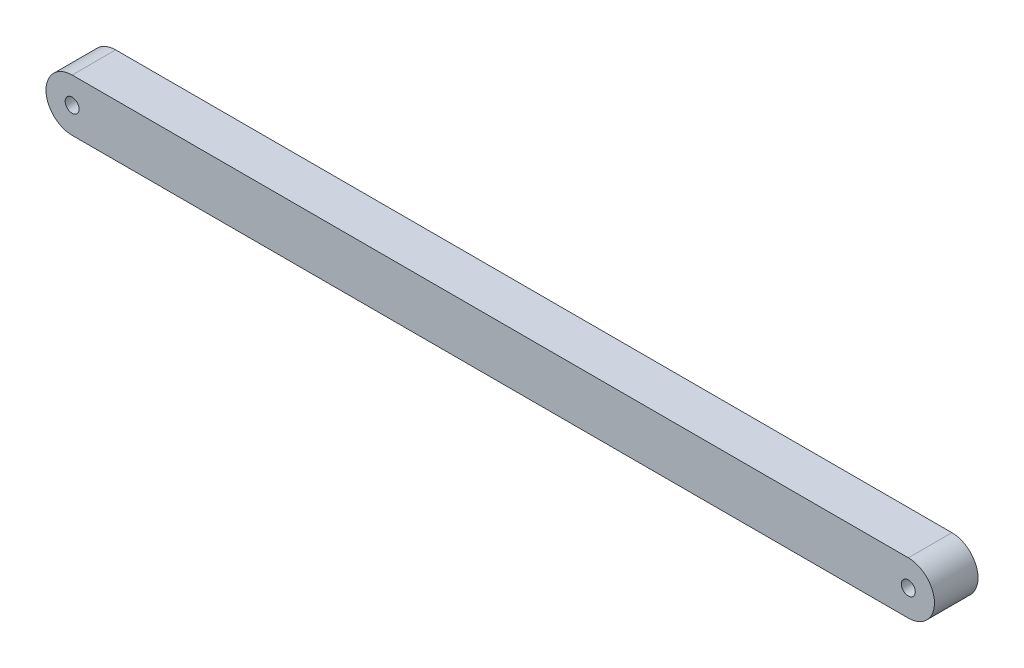
ISO-10303-21;
HEADER;
FILE_DESCRIPTION(('STEP AP214'),'2;1');
FILE_NAME('part.step','',(''),(''),'','','');
FILE_SCHEMA(('AUTOMOTIVE_DESIGN { 1 0 10303 214 1 1 1 1 }'));
ENDSEC;
DATA;
#1=APPLICATION_CONTEXT('core data for automotive mechanical design processes');
#2=APPLICATION_PROTOCOL_DEFINITION('international standard','automotive_design',2000,#1);
#3=PRODUCT_CONTEXT('',#1,'mechanical');
#4=PRODUCT('Part','Part','',(#3));
#5=PRODUCT_RELATED_PRODUCT_CATEGORY('part','',(#4));
#6=PRODUCT_DEFINITION_FORMATION('','',#4);
#7=PRODUCT_DEFINITION_CONTEXT('part definition',#1,'design');
#8=PRODUCT_DEFINITION('design','',#6,#7);
#9=PRODUCT_DEFINITION_SHAPE('','',#8);
#10=(LENGTH_UNIT() NAMED_UNIT(*) SI_UNIT(.MILLI.,.METRE.));
#11=(NAMED_UNIT(*) PLANE_ANGLE_UNIT() SI_UNIT($,.RADIAN.));
#12=(NAMED_UNIT(*) SI_UNIT($,.STERADIAN.) SOLID_ANGLE_UNIT());
#13=UNCERTAINTY_MEASURE_WITH_UNIT(LENGTH_MEASURE(1.E-05),#10,'distance_accuracy_value','');
#14=(GEOMETRIC_REPRESENTATION_CONTEXT(3) GLOBAL_UNCERTAINTY_ASSIGNED_CONTEXT((#13)) GLOBAL_UNIT_ASSIGNED_CONTEXT((#10,
#11,#12)) REPRESENTATION_CONTEXT('',''));
#15=CARTESIAN_POINT('',(0.,0.,0.));
#16=DIRECTION('',(0.,0.,1.));
#17=DIRECTION('',(1.,0.,0.));
#18=AXIS2_PLACEMENT_3D('',#15,#16,#17);
#19=CARTESIAN_POINT('',(0.,0.,10.));
#20=DIRECTION('',(0.,0.,1.));
#21=DIRECTION('',(1.,0.,0.));
#22=AXIS2_PLACEMENT_3D('',#19,#20,#21);
#23=PLANE('',#22);
#24=CARTESIAN_POINT('',(192.,0.,10.));
#25=DIRECTION('',(0.,0.,1.));
#26=DIRECTION('',(1.,0.,0.));
#27=AXIS2_PLACEMENT_3D('',#24,#25,#26);
#28=CIRCLE('',#27,1.59999999999999);
#29=CARTESIAN_POINT('',(193.6,0.,10.));
#30=VERTEX_POINT('',#29);
#31=EDGE_CURVE('E123',#30,#30,#28,.T.);
#32=ORIENTED_EDGE('',*,*,#31,.F.);
#33=EDGE_LOOP('',(#32));
#34=FACE_BOUND('',#33,.T.);
#35=CARTESIAN_POINT('',(0.,0.,10.));
#36=DIRECTION('',(0.,0.,1.));
#37=DIRECTION('',(1.,0.,0.));
#38=AXIS2_PLACEMENT_3D('',#35,#36,#37);
#39=CIRCLE('',#38,1.6);
#40=CARTESIAN_POINT('',(1.6,0.,10.));
#41=VERTEX_POINT('',#40);
#42=EDGE_CURVE('E101',#41,#41,#39,.T.);
#43=ORIENTED_EDGE('',*,*,#42,.F.);
#44=EDGE_LOOP('',(#43));
#45=FACE_BOUND('',#44,.T.);
#46=DIRECTION('',(1.,0.,0.));
#47=VECTOR('',#46,1.);
#48=CARTESIAN_POINT('',(196.,-6.,10.));
#49=LINE('',#48,#47);
#50=CARTESIAN_POINT('',(0.,-6.,10.));
#51=VERTEX_POINT('',#50);
#52=CARTESIAN_POINT('',(192.,-5.99999999999999,10.));
#53=VERTEX_POINT('',#52);
#54=EDGE_CURVE('E109',#51,#53,#49,.T.);
#55=ORIENTED_EDGE('',*,*,#54,.T.);
#56=CARTESIAN_POINT('',(192.,0.,10.));
#57=DIRECTION('',(0.,0.,1.));
#58=DIRECTION('',(1.,0.,0.));
#59=AXIS2_PLACEMENT_3D('',#56,#57,#58);
#60=CIRCLE('',#59,5.99999999999999);
#61=CARTESIAN_POINT('',(192.,6.,10.));
#62=VERTEX_POINT('',#61);
#63=EDGE_CURVE('E119',#53,#62,#60,.T.);
#64=ORIENTED_EDGE('',*,*,#63,.T.);
#65=DIRECTION('',(-1.,0.,0.));
#66=VECTOR('',#65,1.);
#67=CARTESIAN_POINT('',(0.,6.,10.));
#68=LINE('',#67,#66);
#69=CARTESIAN_POINT('',(0.,6.,10.));
#70=VERTEX_POINT('',#69);
#71=EDGE_CURVE('E72',#62,#70,#68,.T.);
#72=ORIENTED_EDGE('',*,*,#71,.T.);
#73=CARTESIAN_POINT('',(0.,0.,10.));
#74=DIRECTION('',(0.,0.,1.));
#75=DIRECTION('',(1.,0.,0.));
#76=AXIS2_PLACEMENT_3D('',#73,#74,#75);
#77=CIRCLE('',#76,6.);
#78=EDGE_CURVE('E92',#70,#51,#77,.T.);
#79=ORIENTED_EDGE('',*,*,#78,.T.);
#80=EDGE_LOOP('',(#55,#64,#72,#79));
#81=FACE_BOUND('',#80,.T.);
#82=ADVANCED_FACE('F48',(#34,#45,#81),#23,.T.);
#83=CARTESIAN_POINT('',(0.,0.,0.));
#84=DIRECTION('',(0.,0.,1.));
#85=DIRECTION('',(1.,0.,0.));
#86=AXIS2_PLACEMENT_3D('',#83,#84,#85);
#87=PLANE('',#86);
#88=CARTESIAN_POINT('',(192.,0.,0.));
#89=DIRECTION('',(0.,0.,1.));
#90=DIRECTION('',(1.,0.,0.));
#91=AXIS2_PLACEMENT_3D('',#88,#89,#90);
#92=CIRCLE('',#91,1.59999999999999);
#93=CARTESIAN_POINT('',(193.6,0.,0.));
#94=VERTEX_POINT('',#93);
#95=EDGE_CURVE('E121',#94,#94,#92,.T.);
#96=ORIENTED_EDGE('',*,*,#95,.T.);
#97=EDGE_LOOP('',(#96));
#98=FACE_BOUND('',#97,.T.);
#99=CARTESIAN_POINT('',(0.,0.,0.));
#100=DIRECTION('',(0.,0.,1.));
#101=DIRECTION('',(1.,0.,0.));
#102=AXIS2_PLACEMENT_3D('',#99,#100,#101);
#103=CIRCLE('',#102,1.6);
#104=CARTESIAN_POINT('',(1.6,0.,0.));
#105=VERTEX_POINT('',#104);
#106=EDGE_CURVE('E105',#105,#105,#103,.T.);
#107=ORIENTED_EDGE('',*,*,#106,.T.);
#108=EDGE_LOOP('',(#107));
#109=FACE_BOUND('',#108,.T.);
#110=CARTESIAN_POINT('',(192.,0.,0.));
#111=DIRECTION('',(0.,0.,1.));
#112=DIRECTION('',(1.,0.,0.));
#113=AXIS2_PLACEMENT_3D('',#110,#111,#112);
#114=CIRCLE('',#113,5.99999999999999);
#115=CARTESIAN_POINT('',(192.,-5.99999999999999,0.));
#116=VERTEX_POINT('',#115);
#117=CARTESIAN_POINT('',(192.,6.,0.));
#118=VERTEX_POINT('',#117);
#119=EDGE_CURVE('E63',#116,#118,#114,.T.);
#120=ORIENTED_EDGE('',*,*,#119,.F.);
#121=DIRECTION('',(1.,0.,0.));
#122=VECTOR('',#121,1.);
#123=CARTESIAN_POINT('',(196.,-6.,0.));
#124=LINE('',#123,#122);
#125=CARTESIAN_POINT('',(0.,-6.,0.));
#126=VERTEX_POINT('',#125);
#127=EDGE_CURVE('E93',#126,#116,#124,.T.);
#128=ORIENTED_EDGE('',*,*,#127,.F.);
#129=CARTESIAN_POINT('',(0.,0.,0.));
#130=DIRECTION('',(0.,0.,1.));
#131=DIRECTION('',(1.,0.,0.));
#132=AXIS2_PLACEMENT_3D('',#129,#130,#131);
#133=CIRCLE('',#132,6.);
#134=CARTESIAN_POINT('',(0.,6.,0.));
#135=VERTEX_POINT('',#134);
#136=EDGE_CURVE('E98',#135,#126,#133,.T.);
#137=ORIENTED_EDGE('',*,*,#136,.F.);
#138=DIRECTION('',(-1.,0.,0.));
#139=VECTOR('',#138,1.);
#140=CARTESIAN_POINT('',(0.,6.,0.));
#141=LINE('',#140,#139);
#142=EDGE_CURVE('E85',#118,#135,#141,.T.);
#143=ORIENTED_EDGE('',*,*,#142,.F.);
#144=EDGE_LOOP('',(#120,#128,#137,#143));
#145=FACE_BOUND('',#144,.T.);
#146=ADVANCED_FACE('F99',(#98,#109,#145),#87,.F.);
#147=CARTESIAN_POINT('',(0.,6.,10.));
#148=DIRECTION('',(0.,-1.,0.));
#149=DIRECTION('',(1.,0.,0.));
#150=AXIS2_PLACEMENT_3D('',#147,#148,#149);
#151=PLANE('',#150);
#152=DIRECTION('',(0.,0.,1.));
#153=VECTOR('',#152,1.);
#154=CARTESIAN_POINT('',(192.,6.,0.));
#155=LINE('',#154,#153);
#156=EDGE_CURVE('E89',#118,#62,#155,.T.);
#157=ORIENTED_EDGE('',*,*,#156,.F.);
#158=ORIENTED_EDGE('',*,*,#142,.T.);
#159=DIRECTION('',(0.,0.,-1.));
#160=VECTOR('',#159,1.);
#161=CARTESIAN_POINT('',(0.,6.,10.));
#162=LINE('',#161,#160);
#163=EDGE_CURVE('E56',#70,#135,#162,.T.);
#164=ORIENTED_EDGE('',*,*,#163,.F.);
#165=ORIENTED_EDGE('',*,*,#71,.F.);
#166=EDGE_LOOP('',(#157,#158,#164,#165));
#167=FACE_BOUND('',#166,.T.);
#168=ADVANCED_FACE('F87',(#167),#151,.F.);
#169=CARTESIAN_POINT('',(0.,0.,10.));
#170=DIRECTION('',(0.,0.,-1.));
#171=DIRECTION('',(-1.,0.,0.));
#172=AXIS2_PLACEMENT_3D('',#169,#170,#171);
#173=CYLINDRICAL_SURFACE('',#172,6.);
#174=ORIENTED_EDGE('',*,*,#136,.T.);
#175=DIRECTION('',(0.,0.,-1.));
#176=VECTOR('',#175,1.);
#177=CARTESIAN_POINT('',(0.,-6.,10.));
#178=LINE('',#177,#176);
#179=EDGE_CURVE('E12',#51,#126,#178,.T.);
#180=ORIENTED_EDGE('',*,*,#179,.F.);
#181=ORIENTED_EDGE('',*,*,#78,.F.);
#182=ORIENTED_EDGE('',*,*,#163,.T.);
#183=EDGE_LOOP('',(#174,#180,#181,#182));
#184=FACE_BOUND('',#183,.T.);
#185=ADVANCED_FACE('F50',(#184),#173,.T.);
#186=CARTESIAN_POINT('',(196.,-6.,10.));
#187=DIRECTION('',(0.,1.,0.));
#188=DIRECTION('',(-1.,0.,0.));
#189=AXIS2_PLACEMENT_3D('',#186,#187,#188);
#190=PLANE('',#189);
#191=ORIENTED_EDGE('',*,*,#127,.T.);
#192=DIRECTION('',(0.,0.,1.));
#193=VECTOR('',#192,1.);
#194=CARTESIAN_POINT('',(192.,-5.99999999999999,0.));
#195=LINE('',#194,#193);
#196=EDGE_CURVE('E115',#116,#53,#195,.T.);
#197=ORIENTED_EDGE('',*,*,#196,.T.);
#198=ORIENTED_EDGE('',*,*,#54,.F.);
#199=ORIENTED_EDGE('',*,*,#179,.T.);
#200=EDGE_LOOP('',(#191,#197,#198,#199));
#201=FACE_BOUND('',#200,.T.);
#202=ADVANCED_FACE('F147',(#201),#190,.F.);
#203=CARTESIAN_POINT('',(0.,0.,10.));
#204=DIRECTION('',(0.,0.,-1.));
#205=DIRECTION('',(-1.,0.,0.));
#206=AXIS2_PLACEMENT_3D('',#203,#204,#205);
#207=CYLINDRICAL_SURFACE('',#206,1.6);
#208=ORIENTED_EDGE('',*,*,#42,.T.);
#209=EDGE_LOOP('',(#208));
#210=FACE_BOUND('',#209,.T.);
#211=ORIENTED_EDGE('',*,*,#106,.F.);
#212=EDGE_LOOP('',(#211));
#213=FACE_BOUND('',#212,.T.);
#214=ADVANCED_FACE('F150',(#210,#213),#207,.F.);
#215=CARTESIAN_POINT('',(192.,0.,0.));
#216=DIRECTION('',(0.,0.,1.));
#217=DIRECTION('',(1.,0.,0.));
#218=AXIS2_PLACEMENT_3D('',#215,#216,#217);
#219=CYLINDRICAL_SURFACE('',#218,5.99999999999999);
#220=ORIENTED_EDGE('',*,*,#63,.F.);
#221=ORIENTED_EDGE('',*,*,#196,.F.);
#222=ORIENTED_EDGE('',*,*,#119,.T.);
#223=ORIENTED_EDGE('',*,*,#156,.T.);
#224=EDGE_LOOP('',(#220,#221,#222,#223));
#225=FACE_BOUND('',#224,.T.);
#226=ADVANCED_FACE('F134',(#225),#219,.T.);
#227=CARTESIAN_POINT('',(192.,0.,0.));
#228=DIRECTION('',(0.,0.,1.));
#229=DIRECTION('',(1.,0.,0.));
#230=AXIS2_PLACEMENT_3D('',#227,#228,#229);
#231=CYLINDRICAL_SURFACE('',#230,1.59999999999999);
#232=ORIENTED_EDGE('',*,*,#95,.F.);
#233=EDGE_LOOP('',(#232));
#234=FACE_BOUND('',#233,.T.);
#235=ORIENTED_EDGE('',*,*,#31,.T.);
#236=EDGE_LOOP('',(#235));
#237=FACE_BOUND('',#236,.T.);
#238=ADVANCED_FACE('F131',(#234,#237),#231,.F.);
#239=CLOSED_SHELL('',(#82,#146,#168,#185,#202,#214,#226,#238));
#240=MANIFOLD_SOLID_BREP('B2',#239);
#241=ADVANCED_BREP_SHAPE_REPRESENTATION('',(#18,#240),#14);
#242=SHAPE_DEFINITION_REPRESENTATION(#9,#241);
ENDSEC;
END-ISO-10303-21;
